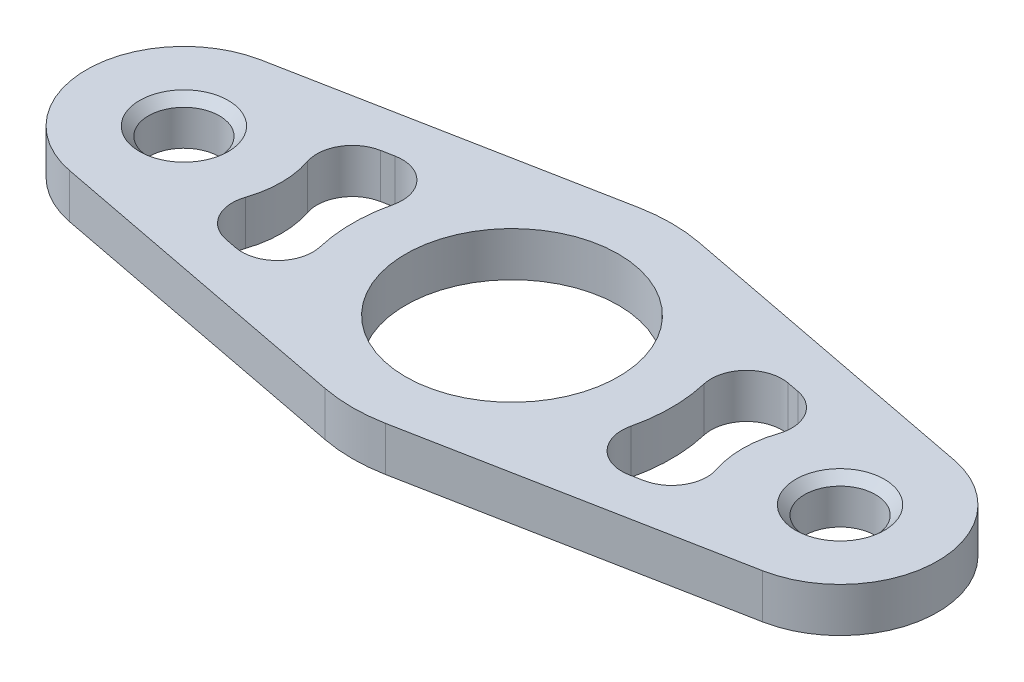
ISO-10303-21;
HEADER;
FILE_DESCRIPTION(('STEP AP214'),'2;1');
FILE_NAME('part.step','',(''),(''),'','','');
FILE_SCHEMA(('AUTOMOTIVE_DESIGN { 1 0 10303 214 1 1 1 1 }'));
ENDSEC;
DATA;
#1=APPLICATION_CONTEXT('core data for automotive mechanical design processes');
#2=APPLICATION_PROTOCOL_DEFINITION('international standard','automotive_design',2000,#1);
#3=PRODUCT_CONTEXT('',#1,'mechanical');
#4=PRODUCT('Part','Part','',(#3));
#5=PRODUCT_RELATED_PRODUCT_CATEGORY('part','',(#4));
#6=PRODUCT_DEFINITION_FORMATION('','',#4);
#7=PRODUCT_DEFINITION_CONTEXT('part definition',#1,'design');
#8=PRODUCT_DEFINITION('design','',#6,#7);
#9=PRODUCT_DEFINITION_SHAPE('','',#8);
#10=(LENGTH_UNIT() NAMED_UNIT(*) SI_UNIT(.MILLI.,.METRE.));
#11=(NAMED_UNIT(*) PLANE_ANGLE_UNIT() SI_UNIT($,.RADIAN.));
#12=(NAMED_UNIT(*) SI_UNIT($,.STERADIAN.) SOLID_ANGLE_UNIT());
#13=UNCERTAINTY_MEASURE_WITH_UNIT(LENGTH_MEASURE(1.E-05),#10,'distance_accuracy_value','');
#14=(GEOMETRIC_REPRESENTATION_CONTEXT(3) GLOBAL_UNCERTAINTY_ASSIGNED_CONTEXT((#13)) GLOBAL_UNIT_ASSIGNED_CONTEXT((#10,
#11,#12)) REPRESENTATION_CONTEXT('',''));
#15=CARTESIAN_POINT('',(0.,0.,0.));
#16=DIRECTION('',(0.,0.,1.));
#17=DIRECTION('',(1.,0.,0.));
#18=AXIS2_PLACEMENT_3D('',#15,#16,#17);
#19=CARTESIAN_POINT('',(3.40540540540541,2.5,-17.6749317968935));
#20=DIRECTION('',(-0.189189189189189,0.,0.98194065538297));
#21=DIRECTION('',(0.98194065538297,0.,0.189189189189189));
#22=AXIS2_PLACEMENT_3D('',#19,#20,#21);
#23=PLANE('',#22);
#24=DIRECTION('',(-0.98194065538297,0.,-0.189189189189189));
#25=VECTOR('',#24,1.);
#26=CARTESIAN_POINT('',(3.40540540540541,-2.5,-17.6749317968935));
#27=LINE('',#26,#25);
#28=CARTESIAN_POINT('',(39.0810810810811,-2.5,-10.8013472092127));
#29=VERTEX_POINT('',#28);
#30=CARTESIAN_POINT('',(3.40540540540541,-2.5,-17.6749317968935));
#31=VERTEX_POINT('',#30);
#32=EDGE_CURVE('E234',#29,#31,#27,.T.);
#33=ORIENTED_EDGE('',*,*,#32,.T.);
#34=DIRECTION('',(0.,-1.,0.));
#35=VECTOR('',#34,1.);
#36=CARTESIAN_POINT('',(3.40540540540541,2.5,-17.6749317968935));
#37=LINE('',#36,#35);
#38=CARTESIAN_POINT('',(3.40540540540541,2.5,-17.6749317968935));
#39=VERTEX_POINT('',#38);
#40=EDGE_CURVE('E213',#39,#31,#37,.T.);
#41=ORIENTED_EDGE('',*,*,#40,.F.);
#42=DIRECTION('',(-0.98194065538297,0.,-0.189189189189189));
#43=VECTOR('',#42,1.);
#44=CARTESIAN_POINT('',(3.40540540540541,2.5,-17.6749317968935));
#45=LINE('',#44,#43);
#46=CARTESIAN_POINT('',(39.0810810810811,2.5,-10.8013472092127));
#47=VERTEX_POINT('',#46);
#48=EDGE_CURVE('E221',#47,#39,#45,.T.);
#49=ORIENTED_EDGE('',*,*,#48,.F.);
#50=DIRECTION('',(0.,-1.,0.));
#51=VECTOR('',#50,1.);
#52=CARTESIAN_POINT('',(39.0810810810811,2.5,-10.8013472092127));
#53=LINE('',#52,#51);
#54=EDGE_CURVE('E448',#47,#29,#53,.T.);
#55=ORIENTED_EDGE('',*,*,#54,.T.);
#56=EDGE_LOOP('',(#33,#41,#49,#55));
#57=FACE_BOUND('',#56,.T.);
#58=ADVANCED_FACE('F43',(#57),#23,.F.);
#59=CARTESIAN_POINT('',(0.,2.5,0.));
#60=DIRECTION('',(0.,-1.,0.));
#61=DIRECTION('',(0.,0.,-1.));
#62=AXIS2_PLACEMENT_3D('',#59,#60,#61);
#63=CYLINDRICAL_SURFACE('',#62,18.);
#64=CARTESIAN_POINT('',(0.,-2.5,0.));
#65=DIRECTION('',(0.,1.,0.));
#66=DIRECTION('',(0.,0.,1.));
#67=AXIS2_PLACEMENT_3D('',#64,#65,#66);
#68=CIRCLE('',#67,18.);
#69=CARTESIAN_POINT('',(-3.40540540540541,-2.5,-17.6749317968935));
#70=VERTEX_POINT('',#69);
#71=EDGE_CURVE('E423',#31,#70,#68,.T.);
#72=ORIENTED_EDGE('',*,*,#71,.T.);
#73=DIRECTION('',(0.,-1.,0.));
#74=VECTOR('',#73,1.);
#75=CARTESIAN_POINT('',(-3.40540540540541,2.5,-17.6749317968935));
#76=LINE('',#75,#74);
#77=CARTESIAN_POINT('',(-3.40540540540541,2.5,-17.6749317968935));
#78=VERTEX_POINT('',#77);
#79=EDGE_CURVE('E215',#78,#70,#76,.T.);
#80=ORIENTED_EDGE('',*,*,#79,.F.);
#81=CARTESIAN_POINT('',(0.,2.5,0.));
#82=DIRECTION('',(0.,1.,0.));
#83=DIRECTION('',(0.,0.,1.));
#84=AXIS2_PLACEMENT_3D('',#81,#82,#83);
#85=CIRCLE('',#84,18.);
#86=EDGE_CURVE('E208',#39,#78,#85,.T.);
#87=ORIENTED_EDGE('',*,*,#86,.F.);
#88=ORIENTED_EDGE('',*,*,#40,.T.);
#89=EDGE_LOOP('',(#72,#80,#87,#88));
#90=FACE_BOUND('',#89,.T.);
#91=ADVANCED_FACE('F211',(#90),#63,.T.);
#92=CARTESIAN_POINT('',(-3.40540540540541,2.5,-17.6749317968935));
#93=DIRECTION('',(-0.189189189189189,0.,-0.98194065538297));
#94=DIRECTION('',(-0.98194065538297,0.,0.189189189189189));
#95=AXIS2_PLACEMENT_3D('',#92,#93,#94);
#96=PLANE('',#95);
#97=DIRECTION('',(0.98194065538297,0.,-0.189189189189189));
#98=VECTOR('',#97,1.);
#99=CARTESIAN_POINT('',(-3.40540540540541,-2.5,-17.6749317968935));
#100=LINE('',#99,#98);
#101=CARTESIAN_POINT('',(-39.0810810810811,-2.5,-10.8013472092127));
#102=VERTEX_POINT('',#101);
#103=EDGE_CURVE('E426',#102,#70,#100,.T.);
#104=ORIENTED_EDGE('',*,*,#103,.F.);
#105=DIRECTION('',(0.,-1.,0.));
#106=VECTOR('',#105,1.);
#107=CARTESIAN_POINT('',(-39.0810810810811,2.5,-10.8013472092127));
#108=LINE('',#107,#106);
#109=CARTESIAN_POINT('',(-39.0810810810811,2.5,-10.8013472092127));
#110=VERTEX_POINT('',#109);
#111=EDGE_CURVE('E242',#110,#102,#108,.T.);
#112=ORIENTED_EDGE('',*,*,#111,.F.);
#113=DIRECTION('',(0.98194065538297,0.,-0.189189189189189));
#114=VECTOR('',#113,1.);
#115=CARTESIAN_POINT('',(-3.40540540540541,2.5,-17.6749317968935));
#116=LINE('',#115,#114);
#117=EDGE_CURVE('E220',#110,#78,#116,.T.);
#118=ORIENTED_EDGE('',*,*,#117,.T.);
#119=ORIENTED_EDGE('',*,*,#79,.T.);
#120=EDGE_LOOP('',(#104,#112,#118,#119));
#121=FACE_BOUND('',#120,.T.);
#122=ADVANCED_FACE('F475',(#121),#96,.T.);
#123=CARTESIAN_POINT('',(-37.,2.5,0.));
#124=DIRECTION('',(0.,-1.,0.));
#125=DIRECTION('',(0.,0.,-1.));
#126=AXIS2_PLACEMENT_3D('',#123,#124,#125);
#127=CYLINDRICAL_SURFACE('',#126,11.);
#128=CARTESIAN_POINT('',(-37.,-2.5,0.));
#129=DIRECTION('',(0.,1.,0.));
#130=DIRECTION('',(0.,0.,1.));
#131=AXIS2_PLACEMENT_3D('',#128,#129,#130);
#132=CIRCLE('',#131,11.);
#133=CARTESIAN_POINT('',(-39.0810810810811,-2.5,10.8013472092127));
#134=VERTEX_POINT('',#133);
#135=EDGE_CURVE('E430',#102,#134,#132,.T.);
#136=ORIENTED_EDGE('',*,*,#135,.T.);
#137=DIRECTION('',(0.,-1.,0.));
#138=VECTOR('',#137,1.);
#139=CARTESIAN_POINT('',(-39.0810810810811,2.5,10.8013472092127));
#140=LINE('',#139,#138);
#141=CARTESIAN_POINT('',(-39.0810810810811,2.5,10.8013472092127));
#142=VERTEX_POINT('',#141);
#143=EDGE_CURVE('E461',#142,#134,#140,.T.);
#144=ORIENTED_EDGE('',*,*,#143,.F.);
#145=CARTESIAN_POINT('',(-37.,2.5,0.));
#146=DIRECTION('',(0.,1.,0.));
#147=DIRECTION('',(0.,0.,1.));
#148=AXIS2_PLACEMENT_3D('',#145,#146,#147);
#149=CIRCLE('',#148,11.);
#150=EDGE_CURVE('E470',#110,#142,#149,.T.);
#151=ORIENTED_EDGE('',*,*,#150,.F.);
#152=ORIENTED_EDGE('',*,*,#111,.T.);
#153=EDGE_LOOP('',(#136,#144,#151,#152));
#154=FACE_BOUND('',#153,.T.);
#155=ADVANCED_FACE('F468',(#154),#127,.T.);
#156=CARTESIAN_POINT('',(-3.4054054054054,2.5,17.6749317968935));
#157=DIRECTION('',(0.189189189189189,0.,-0.98194065538297));
#158=DIRECTION('',(-0.98194065538297,0.,-0.189189189189189));
#159=AXIS2_PLACEMENT_3D('',#156,#157,#158);
#160=PLANE('',#159);
#161=DIRECTION('',(0.98194065538297,0.,0.189189189189189));
#162=VECTOR('',#161,1.);
#163=CARTESIAN_POINT('',(-3.4054054054054,-2.5,17.6749317968935));
#164=LINE('',#163,#162);
#165=CARTESIAN_POINT('',(-3.4054054054054,-2.5,17.6749317968935));
#166=VERTEX_POINT('',#165);
#167=EDGE_CURVE('E433',#134,#166,#164,.T.);
#168=ORIENTED_EDGE('',*,*,#167,.T.);
#169=DIRECTION('',(0.,-1.,0.));
#170=VECTOR('',#169,1.);
#171=CARTESIAN_POINT('',(-3.4054054054054,2.5,17.6749317968935));
#172=LINE('',#171,#170);
#173=CARTESIAN_POINT('',(-3.4054054054054,2.5,17.6749317968935));
#174=VERTEX_POINT('',#173);
#175=EDGE_CURVE('E457',#174,#166,#172,.T.);
#176=ORIENTED_EDGE('',*,*,#175,.F.);
#177=DIRECTION('',(0.98194065538297,0.,0.189189189189189));
#178=VECTOR('',#177,1.);
#179=CARTESIAN_POINT('',(-3.4054054054054,2.5,17.6749317968935));
#180=LINE('',#179,#178);
#181=EDGE_CURVE('E491',#142,#174,#180,.T.);
#182=ORIENTED_EDGE('',*,*,#181,.F.);
#183=ORIENTED_EDGE('',*,*,#143,.T.);
#184=EDGE_LOOP('',(#168,#176,#182,#183));
#185=FACE_BOUND('',#184,.T.);
#186=ADVANCED_FACE('F490',(#185),#160,.F.);
#187=CARTESIAN_POINT('',(0.,2.5,0.));
#188=DIRECTION('',(0.,-1.,0.));
#189=DIRECTION('',(0.,0.,-1.));
#190=AXIS2_PLACEMENT_3D('',#187,#188,#189);
#191=CYLINDRICAL_SURFACE('',#190,18.);
#192=CARTESIAN_POINT('',(0.,-2.5,0.));
#193=DIRECTION('',(0.,1.,0.));
#194=DIRECTION('',(0.,0.,1.));
#195=AXIS2_PLACEMENT_3D('',#192,#193,#194);
#196=CIRCLE('',#195,18.);
#197=CARTESIAN_POINT('',(3.4054054054054,-2.5,17.6749317968935));
#198=VERTEX_POINT('',#197);
#199=EDGE_CURVE('E436',#166,#198,#196,.T.);
#200=ORIENTED_EDGE('',*,*,#199,.T.);
#201=DIRECTION('',(0.,-1.,0.));
#202=VECTOR('',#201,1.);
#203=CARTESIAN_POINT('',(3.4054054054054,2.5,17.6749317968935));
#204=LINE('',#203,#202);
#205=CARTESIAN_POINT('',(3.4054054054054,2.5,17.6749317968935));
#206=VERTEX_POINT('',#205);
#207=EDGE_CURVE('E454',#206,#198,#204,.T.);
#208=ORIENTED_EDGE('',*,*,#207,.F.);
#209=CARTESIAN_POINT('',(0.,2.5,0.));
#210=DIRECTION('',(0.,1.,0.));
#211=DIRECTION('',(0.,0.,1.));
#212=AXIS2_PLACEMENT_3D('',#209,#210,#211);
#213=CIRCLE('',#212,18.);
#214=EDGE_CURVE('E487',#174,#206,#213,.T.);
#215=ORIENTED_EDGE('',*,*,#214,.F.);
#216=ORIENTED_EDGE('',*,*,#175,.T.);
#217=EDGE_LOOP('',(#200,#208,#215,#216));
#218=FACE_BOUND('',#217,.T.);
#219=ADVANCED_FACE('F484',(#218),#191,.T.);
#220=CARTESIAN_POINT('',(3.4054054054054,2.5,17.6749317968935));
#221=DIRECTION('',(0.189189189189189,0.,0.98194065538297));
#222=DIRECTION('',(0.98194065538297,0.,-0.189189189189189));
#223=AXIS2_PLACEMENT_3D('',#220,#221,#222);
#224=PLANE('',#223);
#225=DIRECTION('',(-0.98194065538297,0.,0.189189189189189));
#226=VECTOR('',#225,1.);
#227=CARTESIAN_POINT('',(3.4054054054054,-2.5,17.6749317968935));
#228=LINE('',#227,#226);
#229=CARTESIAN_POINT('',(39.0810810810811,-2.5,10.8013472092127));
#230=VERTEX_POINT('',#229);
#231=EDGE_CURVE('E440',#230,#198,#228,.T.);
#232=ORIENTED_EDGE('',*,*,#231,.F.);
#233=DIRECTION('',(0.,-1.,0.));
#234=VECTOR('',#233,1.);
#235=CARTESIAN_POINT('',(39.0810810810811,2.5,10.8013472092127));
#236=LINE('',#235,#234);
#237=CARTESIAN_POINT('',(39.0810810810811,2.5,10.8013472092127));
#238=VERTEX_POINT('',#237);
#239=EDGE_CURVE('E451',#238,#230,#236,.T.);
#240=ORIENTED_EDGE('',*,*,#239,.F.);
#241=DIRECTION('',(-0.98194065538297,0.,0.189189189189189));
#242=VECTOR('',#241,1.);
#243=CARTESIAN_POINT('',(3.4054054054054,2.5,17.6749317968935));
#244=LINE('',#243,#242);
#245=EDGE_CURVE('E496',#238,#206,#244,.T.);
#246=ORIENTED_EDGE('',*,*,#245,.T.);
#247=ORIENTED_EDGE('',*,*,#207,.T.);
#248=EDGE_LOOP('',(#232,#240,#246,#247));
#249=FACE_BOUND('',#248,.T.);
#250=ADVANCED_FACE('F481',(#249),#224,.T.);
#251=CARTESIAN_POINT('',(0.,2.5,0.));
#252=DIRECTION('',(0.,-1.,0.));
#253=DIRECTION('',(0.,0.,-1.));
#254=AXIS2_PLACEMENT_3D('',#251,#252,#253);
#255=CYLINDRICAL_SURFACE('',#254,18.);
#256=CARTESIAN_POINT('',(0.,2.5,0.));
#257=DIRECTION('',(0.,1.,0.));
#258=DIRECTION('',(0.,0.,1.));
#259=AXIS2_PLACEMENT_3D('',#256,#257,#258);
#260=CIRCLE('',#259,18.);
#261=CARTESIAN_POINT('',(17.5213831005138,2.5,-4.12324317073715));
#262=VERTEX_POINT('',#261);
#263=CARTESIAN_POINT('',(17.5213831005138,2.5,4.12324317073716));
#264=VERTEX_POINT('',#263);
#265=EDGE_CURVE('E379',#262,#264,#260,.F.);
#266=ORIENTED_EDGE('',*,*,#265,.T.);
#267=DIRECTION('',(0.,-1.,0.));
#268=VECTOR('',#267,1.);
#269=CARTESIAN_POINT('',(17.5213831005138,2.5,4.12324317073716));
#270=LINE('',#269,#268);
#271=CARTESIAN_POINT('',(17.5213831005138,-2.5,4.12324317073716));
#272=VERTEX_POINT('',#271);
#273=EDGE_CURVE('E240',#264,#272,#270,.T.);
#274=ORIENTED_EDGE('',*,*,#273,.T.);
#275=CARTESIAN_POINT('',(0.,-2.5,0.));
#276=DIRECTION('',(0.,1.,0.));
#277=DIRECTION('',(0.,0.,1.));
#278=AXIS2_PLACEMENT_3D('',#275,#276,#277);
#279=CIRCLE('',#278,18.);
#280=CARTESIAN_POINT('',(17.5213831005138,-2.5,-4.12324317073715));
#281=VERTEX_POINT('',#280);
#282=EDGE_CURVE('E408',#281,#272,#279,.F.);
#283=ORIENTED_EDGE('',*,*,#282,.F.);
#284=DIRECTION('',(0.,-1.,0.));
#285=VECTOR('',#284,1.);
#286=CARTESIAN_POINT('',(17.5213831005138,2.5,-4.12324317073715));
#287=LINE('',#286,#285);
#288=EDGE_CURVE('E236',#281,#262,#287,.F.);
#289=ORIENTED_EDGE('',*,*,#288,.T.);
#290=EDGE_LOOP('',(#266,#274,#283,#289));
#291=FACE_BOUND('',#290,.T.);
#292=ADVANCED_FACE('F575',(#291),#255,.T.);
#293=CARTESIAN_POINT('',(2.45945945945946,2.5,-12.7652285199786));
#294=DIRECTION('',(-0.189189189189189,0.,0.98194065538297));
#295=DIRECTION('',(0.98194065538297,0.,0.189189189189189));
#296=AXIS2_PLACEMENT_3D('',#293,#294,#295);
#297=PLANE('',#296);
#298=DIRECTION('',(-0.98194065538297,0.,-0.189189189189189));
#299=VECTOR('',#298,1.);
#300=CARTESIAN_POINT('',(2.45945945945946,-2.5,-12.7652285199786));
#301=LINE('',#300,#299);
#302=CARTESIAN_POINT('',(23.5375378464249,-2.5,-8.70414342503374));
#303=VERTEX_POINT('',#302);
#304=CARTESIAN_POINT('',(22.1717805462736,-2.5,-8.96728205243284));
#305=VERTEX_POINT('',#304);
#306=EDGE_CURVE('E399',#303,#305,#301,.T.);
#307=ORIENTED_EDGE('',*,*,#306,.F.);
#308=DIRECTION('',(0.,1.,0.));
#309=VECTOR('',#308,1.);
#310=CARTESIAN_POINT('',(23.5375378464249,2.5,-8.70414342503374));
#311=LINE('',#310,#309);
#312=CARTESIAN_POINT('',(23.5375378464249,2.5,-8.70414342503374));
#313=VERTEX_POINT('',#312);
#314=EDGE_CURVE('E267',#303,#313,#311,.T.);
#315=ORIENTED_EDGE('',*,*,#314,.T.);
#316=DIRECTION('',(-0.98194065538297,0.,-0.189189189189189));
#317=VECTOR('',#316,1.);
#318=CARTESIAN_POINT('',(2.45945945945946,2.5,-12.7652285199786));
#319=LINE('',#318,#317);
#320=CARTESIAN_POINT('',(22.1717805462736,2.5,-8.96728205243284));
#321=VERTEX_POINT('',#320);
#322=EDGE_CURVE('E388',#313,#321,#319,.T.);
#323=ORIENTED_EDGE('',*,*,#322,.T.);
#324=DIRECTION('',(0.,1.,0.));
#325=VECTOR('',#324,1.);
#326=CARTESIAN_POINT('',(22.1717805462736,-2.5,-8.96728205243284));
#327=LINE('',#326,#325);
#328=EDGE_CURVE('E263',#321,#305,#327,.F.);
#329=ORIENTED_EDGE('',*,*,#328,.T.);
#330=EDGE_LOOP('',(#307,#315,#323,#329));
#331=FACE_BOUND('',#330,.T.);
#332=ADVANCED_FACE('F398',(#331),#297,.T.);
#333=CARTESIAN_POINT('',(37.,2.5,0.));
#334=DIRECTION('',(0.,-1.,0.));
#335=DIRECTION('',(0.,0.,-1.));
#336=AXIS2_PLACEMENT_3D('',#333,#334,#335);
#337=CYLINDRICAL_SURFACE('',#336,11.);
#338=CARTESIAN_POINT('',(37.,-2.5,0.));
#339=DIRECTION('',(0.,1.,0.));
#340=DIRECTION('',(0.,0.,1.));
#341=AXIS2_PLACEMENT_3D('',#338,#339,#340);
#342=CIRCLE('',#341,11.);
#343=CARTESIAN_POINT('',(26.57257279909,-2.5,3.50267925590137));
#344=VERTEX_POINT('',#343);
#345=CARTESIAN_POINT('',(26.57257279909,-2.5,-3.50267925590136));
#346=VERTEX_POINT('',#345);
#347=EDGE_CURVE('E407',#344,#346,#342,.F.);
#348=ORIENTED_EDGE('',*,*,#347,.F.);
#349=DIRECTION('',(0.,-1.,0.));
#350=VECTOR('',#349,1.);
#351=CARTESIAN_POINT('',(26.57257279909,2.5,3.50267925590137));
#352=LINE('',#351,#350);
#353=CARTESIAN_POINT('',(26.57257279909,2.5,3.50267925590137));
#354=VERTEX_POINT('',#353);
#355=EDGE_CURVE('E260',#344,#354,#352,.F.);
#356=ORIENTED_EDGE('',*,*,#355,.T.);
#357=CARTESIAN_POINT('',(37.,2.5,0.));
#358=DIRECTION('',(0.,1.,0.));
#359=DIRECTION('',(0.,0.,1.));
#360=AXIS2_PLACEMENT_3D('',#357,#358,#359);
#361=CIRCLE('',#360,11.);
#362=CARTESIAN_POINT('',(26.57257279909,2.5,-3.50267925590136));
#363=VERTEX_POINT('',#362);
#364=EDGE_CURVE('E561',#354,#363,#361,.F.);
#365=ORIENTED_EDGE('',*,*,#364,.T.);
#366=DIRECTION('',(0.,-1.,0.));
#367=VECTOR('',#366,1.);
#368=CARTESIAN_POINT('',(26.57257279909,2.5,-3.50267925590136));
#369=LINE('',#368,#367);
#370=EDGE_CURVE('E256',#363,#346,#369,.T.);
#371=ORIENTED_EDGE('',*,*,#370,.T.);
#372=EDGE_LOOP('',(#348,#356,#365,#371));
#373=FACE_BOUND('',#372,.T.);
#374=ADVANCED_FACE('F583',(#373),#337,.T.);
#375=CARTESIAN_POINT('',(-2.45945945945946,2.5,12.7652285199786));
#376=DIRECTION('',(0.189189189189189,0.,-0.98194065538297));
#377=DIRECTION('',(-0.98194065538297,0.,-0.189189189189189));
#378=AXIS2_PLACEMENT_3D('',#375,#376,#377);
#379=PLANE('',#378);
#380=DIRECTION('',(0.98194065538297,0.,0.189189189189189));
#381=VECTOR('',#380,1.);
#382=CARTESIAN_POINT('',(-2.45945945945946,2.5,12.7652285199786));
#383=LINE('',#382,#381);
#384=CARTESIAN_POINT('',(-23.5375378464249,2.5,8.70414342503375));
#385=VERTEX_POINT('',#384);
#386=CARTESIAN_POINT('',(-22.1717805462736,2.5,8.96728205243285));
#387=VERTEX_POINT('',#386);
#388=EDGE_CURVE('E376',#385,#387,#383,.T.);
#389=ORIENTED_EDGE('',*,*,#388,.T.);
#390=DIRECTION('',(0.,-1.,0.));
#391=VECTOR('',#390,1.);
#392=CARTESIAN_POINT('',(-22.1717805462736,2.5,8.96728205243285));
#393=LINE('',#392,#391);
#394=CARTESIAN_POINT('',(-22.1717805462736,-2.5,8.96728205243285));
#395=VERTEX_POINT('',#394);
#396=EDGE_CURVE('E273',#387,#395,#393,.T.);
#397=ORIENTED_EDGE('',*,*,#396,.T.);
#398=DIRECTION('',(0.98194065538297,0.,0.189189189189189));
#399=VECTOR('',#398,1.);
#400=CARTESIAN_POINT('',(-2.45945945945946,-2.5,12.7652285199786));
#401=LINE('',#400,#399);
#402=CARTESIAN_POINT('',(-23.5375378464249,-2.5,8.70414342503375));
#403=VERTEX_POINT('',#402);
#404=EDGE_CURVE('E517',#403,#395,#401,.T.);
#405=ORIENTED_EDGE('',*,*,#404,.F.);
#406=DIRECTION('',(0.,-1.,0.));
#407=VECTOR('',#406,1.);
#408=CARTESIAN_POINT('',(-23.5375378464249,2.5,8.70414342503375));
#409=LINE('',#408,#407);
#410=EDGE_CURVE('E270',#403,#385,#409,.F.);
#411=ORIENTED_EDGE('',*,*,#410,.T.);
#412=EDGE_LOOP('',(#389,#397,#405,#411));
#413=FACE_BOUND('',#412,.T.);
#414=ADVANCED_FACE('F542',(#413),#379,.T.);
#415=CARTESIAN_POINT('',(-37.,2.5,0.));
#416=DIRECTION('',(0.,-1.,0.));
#417=DIRECTION('',(0.,0.,-1.));
#418=AXIS2_PLACEMENT_3D('',#415,#416,#417);
#419=CYLINDRICAL_SURFACE('',#418,11.);
#420=CARTESIAN_POINT('',(-37.,2.5,0.));
#421=DIRECTION('',(0.,1.,0.));
#422=DIRECTION('',(0.,0.,1.));
#423=AXIS2_PLACEMENT_3D('',#420,#421,#422);
#424=CIRCLE('',#423,11.);
#425=CARTESIAN_POINT('',(-26.57257279909,2.5,3.50267925590137));
#426=VERTEX_POINT('',#425);
#427=CARTESIAN_POINT('',(-26.57257279909,2.5,-3.50267925590136));
#428=VERTEX_POINT('',#427);
#429=EDGE_CURVE('E546',#426,#428,#424,.T.);
#430=ORIENTED_EDGE('',*,*,#429,.F.);
#431=DIRECTION('',(0.,-1.,0.));
#432=VECTOR('',#431,1.);
#433=CARTESIAN_POINT('',(-26.57257279909,2.5,3.50267925590137));
#434=LINE('',#433,#432);
#435=CARTESIAN_POINT('',(-26.57257279909,-2.5,3.50267925590137));
#436=VERTEX_POINT('',#435);
#437=EDGE_CURVE('E293',#426,#436,#434,.T.);
#438=ORIENTED_EDGE('',*,*,#437,.T.);
#439=CARTESIAN_POINT('',(-37.,-2.5,0.));
#440=DIRECTION('',(0.,1.,0.));
#441=DIRECTION('',(0.,0.,1.));
#442=AXIS2_PLACEMENT_3D('',#439,#440,#441);
#443=CIRCLE('',#442,11.);
#444=CARTESIAN_POINT('',(-26.57257279909,-2.5,-3.50267925590136));
#445=VERTEX_POINT('',#444);
#446=EDGE_CURVE('E521',#436,#445,#443,.T.);
#447=ORIENTED_EDGE('',*,*,#446,.T.);
#448=DIRECTION('',(0.,-1.,0.));
#449=VECTOR('',#448,1.);
#450=CARTESIAN_POINT('',(-26.57257279909,2.5,-3.50267925590136));
#451=LINE('',#450,#449);
#452=EDGE_CURVE('E60',#445,#428,#451,.F.);
#453=ORIENTED_EDGE('',*,*,#452,.T.);
#454=EDGE_LOOP('',(#430,#438,#447,#453));
#455=FACE_BOUND('',#454,.T.);
#456=ADVANCED_FACE('F618',(#455),#419,.T.);
#457=CARTESIAN_POINT('',(-2.45945945945946,2.5,-12.7652285199786));
#458=DIRECTION('',(-0.189189189189189,0.,-0.98194065538297));
#459=DIRECTION('',(-0.98194065538297,0.,0.189189189189189));
#460=AXIS2_PLACEMENT_3D('',#457,#458,#459);
#461=PLANE('',#460);
#462=DIRECTION('',(0.98194065538297,0.,-0.189189189189189));
#463=VECTOR('',#462,1.);
#464=CARTESIAN_POINT('',(-2.45945945945946,-2.5,-12.7652285199786));
#465=LINE('',#464,#463);
#466=CARTESIAN_POINT('',(-23.5375378464249,-2.5,-8.70414342503374));
#467=VERTEX_POINT('',#466);
#468=CARTESIAN_POINT('',(-22.1717805462736,-2.5,-8.96728205243284));
#469=VERTEX_POINT('',#468);
#470=EDGE_CURVE('E524',#467,#469,#465,.T.);
#471=ORIENTED_EDGE('',*,*,#470,.T.);
#472=DIRECTION('',(0.,1.,0.));
#473=VECTOR('',#472,1.);
#474=CARTESIAN_POINT('',(-22.1717805462736,2.5,-8.96728205243284));
#475=LINE('',#474,#473);
#476=CARTESIAN_POINT('',(-22.1717805462736,2.5,-8.96728205243284));
#477=VERTEX_POINT('',#476);
#478=EDGE_CURVE('E288',#469,#477,#475,.T.);
#479=ORIENTED_EDGE('',*,*,#478,.T.);
#480=DIRECTION('',(0.98194065538297,0.,-0.189189189189189));
#481=VECTOR('',#480,1.);
#482=CARTESIAN_POINT('',(-2.45945945945946,2.5,-12.7652285199786));
#483=LINE('',#482,#481);
#484=CARTESIAN_POINT('',(-23.5375378464249,2.5,-8.70414342503374));
#485=VERTEX_POINT('',#484);
#486=EDGE_CURVE('E550',#485,#477,#483,.T.);
#487=ORIENTED_EDGE('',*,*,#486,.F.);
#488=DIRECTION('',(0.,1.,0.));
#489=VECTOR('',#488,1.);
#490=CARTESIAN_POINT('',(-23.5375378464249,-2.5,-8.70414342503374));
#491=LINE('',#490,#489);
#492=EDGE_CURVE('E284',#485,#467,#491,.F.);
#493=ORIENTED_EDGE('',*,*,#492,.T.);
#494=EDGE_LOOP('',(#471,#479,#487,#493));
#495=FACE_BOUND('',#494,.T.);
#496=ADVANCED_FACE('F606',(#495),#461,.F.);
#497=CARTESIAN_POINT('',(2.45945945945946,2.5,12.7652285199786));
#498=DIRECTION('',(0.189189189189189,0.,0.98194065538297));
#499=DIRECTION('',(0.98194065538297,0.,-0.189189189189189));
#500=AXIS2_PLACEMENT_3D('',#497,#498,#499);
#501=PLANE('',#500);
#502=DIRECTION('',(-0.98194065538297,0.,0.189189189189189));
#503=VECTOR('',#502,1.);
#504=CARTESIAN_POINT('',(2.45945945945946,-2.5,12.7652285199786));
#505=LINE('',#504,#503);
#506=CARTESIAN_POINT('',(23.5375378464249,-2.5,8.70414342503375));
#507=VERTEX_POINT('',#506);
#508=CARTESIAN_POINT('',(22.1717805462736,-2.5,8.96728205243285));
#509=VERTEX_POINT('',#508);
#510=EDGE_CURVE('E412',#507,#509,#505,.T.);
#511=ORIENTED_EDGE('',*,*,#510,.T.);
#512=DIRECTION('',(0.,-1.,0.));
#513=VECTOR('',#512,1.);
#514=CARTESIAN_POINT('',(22.1717805462736,2.5,8.96728205243285));
#515=LINE('',#514,#513);
#516=CARTESIAN_POINT('',(22.1717805462736,2.5,8.96728205243285));
#517=VERTEX_POINT('',#516);
#518=EDGE_CURVE('E253',#509,#517,#515,.F.);
#519=ORIENTED_EDGE('',*,*,#518,.T.);
#520=DIRECTION('',(-0.98194065538297,0.,0.189189189189189));
#521=VECTOR('',#520,1.);
#522=CARTESIAN_POINT('',(2.45945945945946,2.5,12.7652285199786));
#523=LINE('',#522,#521);
#524=CARTESIAN_POINT('',(23.5375378464249,2.5,8.70414342503375));
#525=VERTEX_POINT('',#524);
#526=EDGE_CURVE('E231',#525,#517,#523,.T.);
#527=ORIENTED_EDGE('',*,*,#526,.F.);
#528=DIRECTION('',(0.,-1.,0.));
#529=VECTOR('',#528,1.);
#530=CARTESIAN_POINT('',(23.5375378464249,2.5,8.70414342503375));
#531=LINE('',#530,#529);
#532=EDGE_CURVE('E249',#525,#507,#531,.T.);
#533=ORIENTED_EDGE('',*,*,#532,.T.);
#534=EDGE_LOOP('',(#511,#519,#527,#533));
#535=FACE_BOUND('',#534,.T.);
#536=ADVANCED_FACE('F577',(#535),#501,.F.);
#537=CARTESIAN_POINT('',(0.,2.5,0.));
#538=DIRECTION('',(0.,-1.,0.));
#539=DIRECTION('',(0.,0.,-1.));
#540=AXIS2_PLACEMENT_3D('',#537,#538,#539);
#541=CYLINDRICAL_SURFACE('',#540,18.);
#542=CARTESIAN_POINT('',(0.,-2.5,0.));
#543=DIRECTION('',(0.,1.,0.));
#544=DIRECTION('',(0.,0.,1.));
#545=AXIS2_PLACEMENT_3D('',#542,#543,#544);
#546=CIRCLE('',#545,18.);
#547=CARTESIAN_POINT('',(-17.5213831005138,-2.5,-4.12324317073715));
#548=VERTEX_POINT('',#547);
#549=CARTESIAN_POINT('',(-17.5213831005138,-2.5,4.12324317073716));
#550=VERTEX_POINT('',#549);
#551=EDGE_CURVE('E414',#548,#550,#546,.T.);
#552=ORIENTED_EDGE('',*,*,#551,.T.);
#553=DIRECTION('',(0.,-1.,0.));
#554=VECTOR('',#553,1.);
#555=CARTESIAN_POINT('',(-17.5213831005138,2.5,4.12324317073716));
#556=LINE('',#555,#554);
#557=CARTESIAN_POINT('',(-17.5213831005138,2.5,4.12324317073716));
#558=VERTEX_POINT('',#557);
#559=EDGE_CURVE('E281',#550,#558,#556,.F.);
#560=ORIENTED_EDGE('',*,*,#559,.T.);
#561=CARTESIAN_POINT('',(0.,2.5,0.));
#562=DIRECTION('',(0.,1.,0.));
#563=DIRECTION('',(0.,0.,1.));
#564=AXIS2_PLACEMENT_3D('',#561,#562,#563);
#565=CIRCLE('',#564,18.);
#566=CARTESIAN_POINT('',(-17.5213831005138,2.5,-4.12324317073715));
#567=VERTEX_POINT('',#566);
#568=EDGE_CURVE('E389',#567,#558,#565,.T.);
#569=ORIENTED_EDGE('',*,*,#568,.F.);
#570=DIRECTION('',(0.,-1.,0.));
#571=VECTOR('',#570,1.);
#572=CARTESIAN_POINT('',(-17.5213831005138,2.5,-4.12324317073715));
#573=LINE('',#572,#571);
#574=EDGE_CURVE('E277',#567,#548,#573,.T.);
#575=ORIENTED_EDGE('',*,*,#574,.T.);
#576=EDGE_LOOP('',(#552,#560,#569,#575));
#577=FACE_BOUND('',#576,.T.);
#578=ADVANCED_FACE('F532',(#577),#541,.T.);
#579=CARTESIAN_POINT('',(0.,2.5,0.));
#580=DIRECTION('',(0.,-1.,0.));
#581=DIRECTION('',(0.,0.,-1.));
#582=AXIS2_PLACEMENT_3D('',#579,#580,#581);
#583=CYLINDRICAL_SURFACE('',#582,12.);
#584=CARTESIAN_POINT('',(0.,2.5,0.));
#585=DIRECTION('',(0.,1.,0.));
#586=DIRECTION('',(0.,0.,1.));
#587=AXIS2_PLACEMENT_3D('',#584,#585,#586);
#588=CIRCLE('',#587,12.);
#589=CARTESIAN_POINT('',(0.,2.5,12.));
#590=VERTEX_POINT('',#589);
#591=EDGE_CURVE('E373',#590,#590,#588,.T.);
#592=ORIENTED_EDGE('',*,*,#591,.T.);
#593=EDGE_LOOP('',(#592));
#594=FACE_BOUND('',#593,.T.);
#595=CARTESIAN_POINT('',(0.,-2.5,0.));
#596=DIRECTION('',(0.,1.,0.));
#597=DIRECTION('',(0.,0.,1.));
#598=AXIS2_PLACEMENT_3D('',#595,#596,#597);
#599=CIRCLE('',#598,12.);
#600=CARTESIAN_POINT('',(0.,-2.5,12.));
#601=VERTEX_POINT('',#600);
#602=EDGE_CURVE('E513',#601,#601,#599,.T.);
#603=ORIENTED_EDGE('',*,*,#602,.F.);
#604=EDGE_LOOP('',(#603));
#605=FACE_BOUND('',#604,.T.);
#606=ADVANCED_FACE('F615',(#594,#605),#583,.F.);
#607=CARTESIAN_POINT('',(-37.,2.5,0.));
#608=DIRECTION('',(0.,-1.,0.));
#609=DIRECTION('',(0.,0.,-1.));
#610=AXIS2_PLACEMENT_3D('',#607,#608,#609);
#611=CYLINDRICAL_SURFACE('',#610,4.00000000000001);
#612=CARTESIAN_POINT('',(-37.,1.49999999999999,0.));
#613=DIRECTION('',(0.,1.,0.));
#614=DIRECTION('',(0.,0.,1.));
#615=AXIS2_PLACEMENT_3D('',#612,#613,#614);
#616=CIRCLE('',#615,4.00000000000001);
#617=CARTESIAN_POINT('',(-37.,1.49999999999999,4.00000000000001));
#618=VERTEX_POINT('',#617);
#619=EDGE_CURVE('E11',#618,#618,#616,.T.);
#620=ORIENTED_EDGE('',*,*,#619,.T.);
#621=EDGE_LOOP('',(#620));
#622=FACE_BOUND('',#621,.T.);
#623=CARTESIAN_POINT('',(-37.,-2.5,0.));
#624=DIRECTION('',(0.,1.,0.));
#625=DIRECTION('',(0.,0.,1.));
#626=AXIS2_PLACEMENT_3D('',#623,#624,#625);
#627=CIRCLE('',#626,4.00000000000001);
#628=CARTESIAN_POINT('',(-37.,-2.5,4.00000000000001));
#629=VERTEX_POINT('',#628);
#630=EDGE_CURVE('E509',#629,#629,#627,.T.);
#631=ORIENTED_EDGE('',*,*,#630,.F.);
#632=EDGE_LOOP('',(#631));
#633=FACE_BOUND('',#632,.T.);
#634=ADVANCED_FACE('F626',(#622,#633),#611,.F.);
#635=CARTESIAN_POINT('',(37.,2.5,0.));
#636=DIRECTION('',(0.,-1.,0.));
#637=DIRECTION('',(0.,0.,-1.));
#638=AXIS2_PLACEMENT_3D('',#635,#636,#637);
#639=CYLINDRICAL_SURFACE('',#638,4.00000000000001);
#640=CARTESIAN_POINT('',(37.,1.5,0.));
#641=DIRECTION('',(0.,1.,0.));
#642=DIRECTION('',(0.,0.,1.));
#643=AXIS2_PLACEMENT_3D('',#640,#641,#642);
#644=CIRCLE('',#643,4.00000000000001);
#645=CARTESIAN_POINT('',(37.,1.5,4.00000000000001));
#646=VERTEX_POINT('',#645);
#647=EDGE_CURVE('E53',#646,#646,#644,.T.);
#648=ORIENTED_EDGE('',*,*,#647,.T.);
#649=EDGE_LOOP('',(#648));
#650=FACE_BOUND('',#649,.T.);
#651=CARTESIAN_POINT('',(37.,-2.5,0.));
#652=DIRECTION('',(0.,1.,0.));
#653=DIRECTION('',(0.,0.,1.));
#654=AXIS2_PLACEMENT_3D('',#651,#652,#653);
#655=CIRCLE('',#654,4.00000000000001);
#656=CARTESIAN_POINT('',(37.,-2.5,4.00000000000001));
#657=VERTEX_POINT('',#656);
#658=EDGE_CURVE('E505',#657,#657,#655,.F.);
#659=ORIENTED_EDGE('',*,*,#658,.T.);
#660=EDGE_LOOP('',(#659));
#661=FACE_BOUND('',#660,.T.);
#662=ADVANCED_FACE('F355',(#650,#661),#639,.F.);
#663=CARTESIAN_POINT('',(37.,2.5,0.));
#664=DIRECTION('',(0.,-1.,0.));
#665=DIRECTION('',(0.,0.,-1.));
#666=AXIS2_PLACEMENT_3D('',#663,#664,#665);
#667=CYLINDRICAL_SURFACE('',#666,11.);
#668=CARTESIAN_POINT('',(37.,-2.5,0.));
#669=DIRECTION('',(0.,1.,0.));
#670=DIRECTION('',(0.,0.,1.));
#671=AXIS2_PLACEMENT_3D('',#668,#669,#670);
#672=CIRCLE('',#671,11.);
#673=EDGE_CURVE('E444',#29,#230,#672,.F.);
#674=ORIENTED_EDGE('',*,*,#673,.F.);
#675=ORIENTED_EDGE('',*,*,#54,.F.);
#676=CARTESIAN_POINT('',(37.,2.5,0.));
#677=DIRECTION('',(0.,1.,0.));
#678=DIRECTION('',(0.,0.,1.));
#679=AXIS2_PLACEMENT_3D('',#676,#677,#678);
#680=CIRCLE('',#679,11.);
#681=EDGE_CURVE('E228',#47,#238,#680,.F.);
#682=ORIENTED_EDGE('',*,*,#681,.T.);
#683=ORIENTED_EDGE('',*,*,#239,.T.);
#684=EDGE_LOOP('',(#674,#675,#682,#683));
#685=FACE_BOUND('',#684,.T.);
#686=ADVANCED_FACE('F367',(#685),#667,.T.);
#687=CARTESIAN_POINT('',(0.,2.5,0.));
#688=DIRECTION('',(0.,1.,0.));
#689=DIRECTION('',(0.,0.,1.));
#690=AXIS2_PLACEMENT_3D('',#687,#688,#689);
#691=PLANE('',#690);
#692=CARTESIAN_POINT('',(37.,2.5,0.));
#693=DIRECTION('',(0.,1.,0.));
#694=DIRECTION('',(0.,0.,1.));
#695=AXIS2_PLACEMENT_3D('',#692,#693,#694);
#696=CIRCLE('',#695,5.);
#697=CARTESIAN_POINT('',(37.,2.5,5.00000000000001));
#698=VERTEX_POINT('',#697);
#699=EDGE_CURVE('E348',#698,#698,#696,.F.);
#700=ORIENTED_EDGE('',*,*,#699,.T.);
#701=EDGE_LOOP('',(#700));
#702=FACE_BOUND('',#701,.T.);
#703=CARTESIAN_POINT('',(-37.,2.5,0.));
#704=DIRECTION('',(0.,1.,0.));
#705=DIRECTION('',(0.,0.,1.));
#706=AXIS2_PLACEMENT_3D('',#703,#704,#705);
#707=CIRCLE('',#706,5.00000000000002);
#708=CARTESIAN_POINT('',(-37.,2.5,5.00000000000002));
#709=VERTEX_POINT('',#708);
#710=EDGE_CURVE('E344',#709,#709,#707,.F.);
#711=ORIENTED_EDGE('',*,*,#710,.T.);
#712=EDGE_LOOP('',(#711));
#713=FACE_BOUND('',#712,.T.);
#714=ORIENTED_EDGE('',*,*,#591,.F.);
#715=EDGE_LOOP('',(#714));
#716=FACE_BOUND('',#715,.T.);
#717=ORIENTED_EDGE('',*,*,#388,.F.);
#718=CARTESIAN_POINT('',(-22.7807810896682,2.5,4.77638080350187));
#719=DIRECTION('',(0.,1.,0.));
#720=DIRECTION('',(0.,0.,1.));
#721=AXIS2_PLACEMENT_3D('',#718,#719,#720);
#722=CIRCLE('',#721,4.);
#723=EDGE_CURVE('E67',#385,#426,#722,.F.);
#724=ORIENTED_EDGE('',*,*,#723,.T.);
#725=ORIENTED_EDGE('',*,*,#429,.T.);
#726=CARTESIAN_POINT('',(-22.7807810896682,2.5,-4.77638080350186));
#727=DIRECTION('',(0.,1.,0.));
#728=DIRECTION('',(0.,0.,1.));
#729=AXIS2_PLACEMENT_3D('',#726,#727,#728);
#730=CIRCLE('',#729,4.);
#731=EDGE_CURVE('E341',#428,#485,#730,.F.);
#732=ORIENTED_EDGE('',*,*,#731,.T.);
#733=ORIENTED_EDGE('',*,*,#486,.T.);
#734=CARTESIAN_POINT('',(-21.4150237895168,2.5,-5.03951943090096));
#735=DIRECTION('',(0.,1.,0.));
#736=DIRECTION('',(0.,0.,1.));
#737=AXIS2_PLACEMENT_3D('',#734,#735,#736);
#738=CIRCLE('',#737,4.);
#739=EDGE_CURVE('E330',#477,#567,#738,.F.);
#740=ORIENTED_EDGE('',*,*,#739,.T.);
#741=ORIENTED_EDGE('',*,*,#568,.T.);
#742=CARTESIAN_POINT('',(-21.4150237895168,2.5,5.03951943090097));
#743=DIRECTION('',(0.,1.,0.));
#744=DIRECTION('',(0.,0.,1.));
#745=AXIS2_PLACEMENT_3D('',#742,#743,#744);
#746=CIRCLE('',#745,4.);
#747=EDGE_CURVE('E324',#558,#387,#746,.F.);
#748=ORIENTED_EDGE('',*,*,#747,.T.);
#749=EDGE_LOOP('',(#717,#724,#725,#732,#733,#740,#741,#748));
#750=FACE_BOUND('',#749,.T.);
#751=ORIENTED_EDGE('',*,*,#265,.F.);
#752=CARTESIAN_POINT('',(21.4150237895168,2.5,-5.03951943090096));
#753=DIRECTION('',(0.,1.,0.));
#754=DIRECTION('',(0.,0.,1.));
#755=AXIS2_PLACEMENT_3D('',#752,#753,#754);
#756=CIRCLE('',#755,4.);
#757=EDGE_CURVE('E318',#262,#321,#756,.F.);
#758=ORIENTED_EDGE('',*,*,#757,.T.);
#759=ORIENTED_EDGE('',*,*,#322,.F.);
#760=CARTESIAN_POINT('',(22.7807810896682,2.5,-4.77638080350186));
#761=DIRECTION('',(0.,1.,0.));
#762=DIRECTION('',(0.,0.,1.));
#763=AXIS2_PLACEMENT_3D('',#760,#761,#762);
#764=CIRCLE('',#763,4.);
#765=EDGE_CURVE('E312',#313,#363,#764,.F.);
#766=ORIENTED_EDGE('',*,*,#765,.T.);
#767=ORIENTED_EDGE('',*,*,#364,.F.);
#768=CARTESIAN_POINT('',(22.7807810896682,2.5,4.77638080350187));
#769=DIRECTION('',(0.,1.,0.));
#770=DIRECTION('',(0.,0.,1.));
#771=AXIS2_PLACEMENT_3D('',#768,#769,#770);
#772=CIRCLE('',#771,4.);
#773=EDGE_CURVE('E306',#354,#525,#772,.F.);
#774=ORIENTED_EDGE('',*,*,#773,.T.);
#775=ORIENTED_EDGE('',*,*,#526,.T.);
#776=CARTESIAN_POINT('',(21.4150237895168,2.5,5.03951943090097));
#777=DIRECTION('',(0.,1.,0.));
#778=DIRECTION('',(0.,0.,1.));
#779=AXIS2_PLACEMENT_3D('',#776,#777,#778);
#780=CIRCLE('',#779,4.);
#781=EDGE_CURVE('E300',#517,#264,#780,.F.);
#782=ORIENTED_EDGE('',*,*,#781,.T.);
#783=EDGE_LOOP('',(#751,#758,#759,#766,#767,#774,#775,#782));
#784=FACE_BOUND('',#783,.T.);
#785=ORIENTED_EDGE('',*,*,#48,.T.);
#786=ORIENTED_EDGE('',*,*,#86,.T.);
#787=ORIENTED_EDGE('',*,*,#117,.F.);
#788=ORIENTED_EDGE('',*,*,#150,.T.);
#789=ORIENTED_EDGE('',*,*,#181,.T.);
#790=ORIENTED_EDGE('',*,*,#214,.T.);
#791=ORIENTED_EDGE('',*,*,#245,.F.);
#792=ORIENTED_EDGE('',*,*,#681,.F.);
#793=EDGE_LOOP('',(#785,#786,#787,#788,#789,#790,#791,#792));
#794=FACE_BOUND('',#793,.T.);
#795=ADVANCED_FACE('F225',(#702,#713,#716,#750,#784,#794),#691,.T.);
#796=CARTESIAN_POINT('',(0.,-2.5,0.));
#797=DIRECTION('',(0.,1.,0.));
#798=DIRECTION('',(0.,0.,1.));
#799=AXIS2_PLACEMENT_3D('',#796,#797,#798);
#800=PLANE('',#799);
#801=ORIENTED_EDGE('',*,*,#658,.F.);
#802=EDGE_LOOP('',(#801));
#803=FACE_BOUND('',#802,.T.);
#804=ORIENTED_EDGE('',*,*,#630,.T.);
#805=EDGE_LOOP('',(#804));
#806=FACE_BOUND('',#805,.T.);
#807=ORIENTED_EDGE('',*,*,#602,.T.);
#808=EDGE_LOOP('',(#807));
#809=FACE_BOUND('',#808,.T.);
#810=ORIENTED_EDGE('',*,*,#446,.F.);
#811=CARTESIAN_POINT('',(-22.7807810896682,-2.5,4.77638080350187));
#812=DIRECTION('',(0.,1.,0.));
#813=DIRECTION('',(0.,0.,1.));
#814=AXIS2_PLACEMENT_3D('',#811,#812,#813);
#815=CIRCLE('',#814,4.);
#816=EDGE_CURVE('E333',#436,#403,#815,.T.);
#817=ORIENTED_EDGE('',*,*,#816,.T.);
#818=ORIENTED_EDGE('',*,*,#404,.T.);
#819=CARTESIAN_POINT('',(-21.4150237895168,-2.5,5.03951943090097));
#820=DIRECTION('',(0.,1.,0.));
#821=DIRECTION('',(0.,0.,1.));
#822=AXIS2_PLACEMENT_3D('',#819,#820,#821);
#823=CIRCLE('',#822,4.);
#824=EDGE_CURVE('E321',#395,#550,#823,.T.);
#825=ORIENTED_EDGE('',*,*,#824,.T.);
#826=ORIENTED_EDGE('',*,*,#551,.F.);
#827=CARTESIAN_POINT('',(-21.4150237895168,-2.5,-5.03951943090096));
#828=DIRECTION('',(0.,1.,0.));
#829=DIRECTION('',(0.,0.,1.));
#830=AXIS2_PLACEMENT_3D('',#827,#828,#829);
#831=CIRCLE('',#830,4.);
#832=EDGE_CURVE('E327',#548,#469,#831,.T.);
#833=ORIENTED_EDGE('',*,*,#832,.T.);
#834=ORIENTED_EDGE('',*,*,#470,.F.);
#835=CARTESIAN_POINT('',(-22.7807810896682,-2.5,-4.77638080350186));
#836=DIRECTION('',(0.,1.,0.));
#837=DIRECTION('',(0.,0.,1.));
#838=AXIS2_PLACEMENT_3D('',#835,#836,#837);
#839=CIRCLE('',#838,4.);
#840=EDGE_CURVE('E338',#467,#445,#839,.T.);
#841=ORIENTED_EDGE('',*,*,#840,.T.);
#842=EDGE_LOOP('',(#810,#817,#818,#825,#826,#833,#834,#841));
#843=FACE_BOUND('',#842,.T.);
#844=ORIENTED_EDGE('',*,*,#306,.T.);
#845=CARTESIAN_POINT('',(21.4150237895168,-2.5,-5.03951943090096));
#846=DIRECTION('',(0.,1.,0.));
#847=DIRECTION('',(0.,0.,1.));
#848=AXIS2_PLACEMENT_3D('',#845,#846,#847);
#849=CIRCLE('',#848,4.);
#850=EDGE_CURVE('E315',#305,#281,#849,.T.);
#851=ORIENTED_EDGE('',*,*,#850,.T.);
#852=ORIENTED_EDGE('',*,*,#282,.T.);
#853=CARTESIAN_POINT('',(21.4150237895168,-2.5,5.03951943090097));
#854=DIRECTION('',(0.,1.,0.));
#855=DIRECTION('',(0.,0.,1.));
#856=AXIS2_PLACEMENT_3D('',#853,#854,#855);
#857=CIRCLE('',#856,4.);
#858=EDGE_CURVE('E297',#272,#509,#857,.T.);
#859=ORIENTED_EDGE('',*,*,#858,.T.);
#860=ORIENTED_EDGE('',*,*,#510,.F.);
#861=CARTESIAN_POINT('',(22.7807810896682,-2.5,4.77638080350187));
#862=DIRECTION('',(0.,1.,0.));
#863=DIRECTION('',(0.,0.,1.));
#864=AXIS2_PLACEMENT_3D('',#861,#862,#863);
#865=CIRCLE('',#864,4.);
#866=EDGE_CURVE('E303',#507,#344,#865,.T.);
#867=ORIENTED_EDGE('',*,*,#866,.T.);
#868=ORIENTED_EDGE('',*,*,#347,.T.);
#869=CARTESIAN_POINT('',(22.7807810896682,-2.5,-4.77638080350186));
#870=DIRECTION('',(0.,1.,0.));
#871=DIRECTION('',(0.,0.,1.));
#872=AXIS2_PLACEMENT_3D('',#869,#870,#871);
#873=CIRCLE('',#872,4.);
#874=EDGE_CURVE('E309',#346,#303,#873,.T.);
#875=ORIENTED_EDGE('',*,*,#874,.T.);
#876=EDGE_LOOP('',(#844,#851,#852,#859,#860,#867,#868,#875));
#877=FACE_BOUND('',#876,.T.);
#878=ORIENTED_EDGE('',*,*,#32,.F.);
#879=ORIENTED_EDGE('',*,*,#673,.T.);
#880=ORIENTED_EDGE('',*,*,#231,.T.);
#881=ORIENTED_EDGE('',*,*,#199,.F.);
#882=ORIENTED_EDGE('',*,*,#167,.F.);
#883=ORIENTED_EDGE('',*,*,#135,.F.);
#884=ORIENTED_EDGE('',*,*,#103,.T.);
#885=ORIENTED_EDGE('',*,*,#71,.F.);
#886=EDGE_LOOP('',(#878,#879,#880,#881,#882,#883,#884,#885));
#887=FACE_BOUND('',#886,.T.);
#888=ADVANCED_FACE('F366',(#803,#806,#809,#843,#877,#887),#800,.F.);
#889=CARTESIAN_POINT('',(21.4150237895168,2.5,5.03951943090097));
#890=DIRECTION('',(0.,-1.,0.));
#891=DIRECTION('',(0.,0.,-1.));
#892=AXIS2_PLACEMENT_3D('',#889,#890,#891);
#893=CYLINDRICAL_SURFACE('',#892,4.);
#894=ORIENTED_EDGE('',*,*,#781,.F.);
#895=ORIENTED_EDGE('',*,*,#518,.F.);
#896=ORIENTED_EDGE('',*,*,#858,.F.);
#897=ORIENTED_EDGE('',*,*,#273,.F.);
#898=EDGE_LOOP('',(#894,#895,#896,#897));
#899=FACE_BOUND('',#898,.T.);
#900=ADVANCED_FACE('F574',(#899),#893,.F.);
#901=CARTESIAN_POINT('',(22.7807810896682,2.5,4.77638080350187));
#902=DIRECTION('',(0.,-1.,0.));
#903=DIRECTION('',(0.,0.,-1.));
#904=AXIS2_PLACEMENT_3D('',#901,#902,#903);
#905=CYLINDRICAL_SURFACE('',#904,4.);
#906=ORIENTED_EDGE('',*,*,#773,.F.);
#907=ORIENTED_EDGE('',*,*,#355,.F.);
#908=ORIENTED_EDGE('',*,*,#866,.F.);
#909=ORIENTED_EDGE('',*,*,#532,.F.);
#910=EDGE_LOOP('',(#906,#907,#908,#909));
#911=FACE_BOUND('',#910,.T.);
#912=ADVANCED_FACE('F579',(#911),#905,.F.);
#913=CARTESIAN_POINT('',(22.7807810896682,2.5,-4.77638080350186));
#914=DIRECTION('',(0.,-1.,0.));
#915=DIRECTION('',(0.,0.,-1.));
#916=AXIS2_PLACEMENT_3D('',#913,#914,#915);
#917=CYLINDRICAL_SURFACE('',#916,4.);
#918=ORIENTED_EDGE('',*,*,#765,.F.);
#919=ORIENTED_EDGE('',*,*,#314,.F.);
#920=ORIENTED_EDGE('',*,*,#874,.F.);
#921=ORIENTED_EDGE('',*,*,#370,.F.);
#922=EDGE_LOOP('',(#918,#919,#920,#921));
#923=FACE_BOUND('',#922,.T.);
#924=ADVANCED_FACE('F587',(#923),#917,.F.);
#925=CARTESIAN_POINT('',(21.4150237895168,2.5,-5.03951943090096));
#926=DIRECTION('',(0.,-1.,0.));
#927=DIRECTION('',(0.,0.,-1.));
#928=AXIS2_PLACEMENT_3D('',#925,#926,#927);
#929=CYLINDRICAL_SURFACE('',#928,4.);
#930=ORIENTED_EDGE('',*,*,#757,.F.);
#931=ORIENTED_EDGE('',*,*,#288,.F.);
#932=ORIENTED_EDGE('',*,*,#850,.F.);
#933=ORIENTED_EDGE('',*,*,#328,.F.);
#934=EDGE_LOOP('',(#930,#931,#932,#933));
#935=FACE_BOUND('',#934,.T.);
#936=ADVANCED_FACE('F394',(#935),#929,.F.);
#937=CARTESIAN_POINT('',(-21.4150237895168,2.5,5.03951943090097));
#938=DIRECTION('',(0.,-1.,0.));
#939=DIRECTION('',(0.,0.,-1.));
#940=AXIS2_PLACEMENT_3D('',#937,#938,#939);
#941=CYLINDRICAL_SURFACE('',#940,4.);
#942=ORIENTED_EDGE('',*,*,#747,.F.);
#943=ORIENTED_EDGE('',*,*,#559,.F.);
#944=ORIENTED_EDGE('',*,*,#824,.F.);
#945=ORIENTED_EDGE('',*,*,#396,.F.);
#946=EDGE_LOOP('',(#942,#943,#944,#945));
#947=FACE_BOUND('',#946,.T.);
#948=ADVANCED_FACE('F539',(#947),#941,.F.);
#949=CARTESIAN_POINT('',(-21.4150237895168,2.5,-5.03951943090096));
#950=DIRECTION('',(0.,-1.,0.));
#951=DIRECTION('',(0.,0.,-1.));
#952=AXIS2_PLACEMENT_3D('',#949,#950,#951);
#953=CYLINDRICAL_SURFACE('',#952,4.);
#954=ORIENTED_EDGE('',*,*,#739,.F.);
#955=ORIENTED_EDGE('',*,*,#478,.F.);
#956=ORIENTED_EDGE('',*,*,#832,.F.);
#957=ORIENTED_EDGE('',*,*,#574,.F.);
#958=EDGE_LOOP('',(#954,#955,#956,#957));
#959=FACE_BOUND('',#958,.T.);
#960=ADVANCED_FACE('F764',(#959),#953,.F.);
#961=CARTESIAN_POINT('',(-22.7807810896682,2.5,4.77638080350187));
#962=DIRECTION('',(0.,-1.,0.));
#963=DIRECTION('',(0.,0.,-1.));
#964=AXIS2_PLACEMENT_3D('',#961,#962,#963);
#965=CYLINDRICAL_SURFACE('',#964,4.);
#966=ORIENTED_EDGE('',*,*,#723,.F.);
#967=ORIENTED_EDGE('',*,*,#410,.F.);
#968=ORIENTED_EDGE('',*,*,#816,.F.);
#969=ORIENTED_EDGE('',*,*,#437,.F.);
#970=EDGE_LOOP('',(#966,#967,#968,#969));
#971=FACE_BOUND('',#970,.T.);
#972=ADVANCED_FACE('F766',(#971),#965,.F.);
#973=CARTESIAN_POINT('',(-22.7807810896682,2.5,-4.77638080350186));
#974=DIRECTION('',(0.,-1.,0.));
#975=DIRECTION('',(0.,0.,-1.));
#976=AXIS2_PLACEMENT_3D('',#973,#974,#975);
#977=CYLINDRICAL_SURFACE('',#976,4.);
#978=ORIENTED_EDGE('',*,*,#731,.F.);
#979=ORIENTED_EDGE('',*,*,#452,.F.);
#980=ORIENTED_EDGE('',*,*,#840,.F.);
#981=ORIENTED_EDGE('',*,*,#492,.F.);
#982=EDGE_LOOP('',(#978,#979,#980,#981));
#983=FACE_BOUND('',#982,.T.);
#984=ADVANCED_FACE('F361',(#983),#977,.F.);
#985=CARTESIAN_POINT('',(37.,2.5,0.));
#986=DIRECTION('',(0.,1.,0.));
#987=DIRECTION('',(0.,0.,1.));
#988=AXIS2_PLACEMENT_3D('',#985,#986,#987);
#989=CONICAL_SURFACE('',#988,5.,0.785398163397448);
#990=ORIENTED_EDGE('',*,*,#647,.F.);
#991=EDGE_LOOP('',(#990));
#992=FACE_BOUND('',#991,.T.);
#993=ORIENTED_EDGE('',*,*,#699,.F.);
#994=EDGE_LOOP('',(#993));
#995=FACE_BOUND('',#994,.T.);
#996=ADVANCED_FACE('F358',(#992,#995),#989,.F.);
#997=CARTESIAN_POINT('',(-37.,1.49999999999999,0.));
#998=DIRECTION('',(0.,1.,0.));
#999=DIRECTION('',(0.,0.,1.));
#1000=AXIS2_PLACEMENT_3D('',#997,#998,#999);
#1001=CONICAL_SURFACE('',#1000,4.00000000000001,0.785398163397448);
#1002=ORIENTED_EDGE('',*,*,#710,.F.);
#1003=EDGE_LOOP('',(#1002));
#1004=FACE_BOUND('',#1003,.T.);
#1005=ORIENTED_EDGE('',*,*,#619,.F.);
#1006=EDGE_LOOP('',(#1005));
#1007=FACE_BOUND('',#1006,.T.);
#1008=ADVANCED_FACE('F46',(#1004,#1007),#1001,.F.);
#1009=CLOSED_SHELL('',(#58,#91,#122,#155,#186,#219,#250,#292,#332,#374,#414,#456,#496,#536,#578,
#606,#634,#662,#686,#795,#888,#900,#912,#924,#936,#948,#960,#972,#984,#996,#1008));
#1010=MANIFOLD_SOLID_BREP('B2',#1009);
#1011=ADVANCED_BREP_SHAPE_REPRESENTATION('',(#18,#1010),#14);
#1012=SHAPE_DEFINITION_REPRESENTATION(#9,#1011);
ENDSEC;
END-ISO-10303-21;
